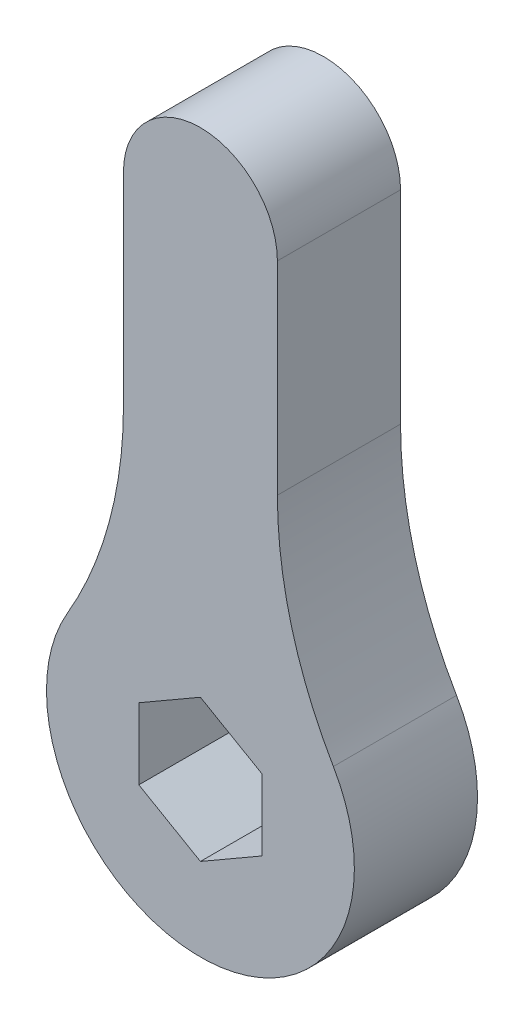
ISO-10303-21;
HEADER;
FILE_DESCRIPTION(('STEP AP214'),'2;1');
FILE_NAME('part.step','',(''),(''),'','','');
FILE_SCHEMA(('AUTOMOTIVE_DESIGN { 1 0 10303 214 1 1 1 1 }'));
ENDSEC;
DATA;
#1=APPLICATION_CONTEXT('core data for automotive mechanical design processes');
#2=APPLICATION_PROTOCOL_DEFINITION('international standard','automotive_design',2000,#1);
#3=PRODUCT_CONTEXT('',#1,'mechanical');
#4=PRODUCT('Part','Part','',(#3));
#5=PRODUCT_RELATED_PRODUCT_CATEGORY('part','',(#4));
#6=PRODUCT_DEFINITION_FORMATION('','',#4);
#7=PRODUCT_DEFINITION_CONTEXT('part definition',#1,'design');
#8=PRODUCT_DEFINITION('design','',#6,#7);
#9=PRODUCT_DEFINITION_SHAPE('','',#8);
#10=(LENGTH_UNIT() NAMED_UNIT(*) SI_UNIT(.MILLI.,.METRE.));
#11=(NAMED_UNIT(*) PLANE_ANGLE_UNIT() SI_UNIT($,.RADIAN.));
#12=(NAMED_UNIT(*) SI_UNIT($,.STERADIAN.) SOLID_ANGLE_UNIT());
#13=UNCERTAINTY_MEASURE_WITH_UNIT(LENGTH_MEASURE(1.E-05),#10,'distance_accuracy_value','');
#14=(GEOMETRIC_REPRESENTATION_CONTEXT(3) GLOBAL_UNCERTAINTY_ASSIGNED_CONTEXT((#13)) GLOBAL_UNIT_ASSIGNED_CONTEXT((#10,
#11,#12)) REPRESENTATION_CONTEXT('',''));
#15=CARTESIAN_POINT('',(0.,0.,0.));
#16=DIRECTION('',(0.,0.,1.));
#17=DIRECTION('',(1.,0.,0.));
#18=AXIS2_PLACEMENT_3D('',#15,#16,#17);
#19=CARTESIAN_POINT('',(0.,23.75,6.));
#20=DIRECTION('',(0.,0.,-1.));
#21=DIRECTION('',(-1.,0.,0.));
#22=AXIS2_PLACEMENT_3D('',#19,#20,#21);
#23=PLANE('',#22);
#24=CARTESIAN_POINT('',(0.,23.75,6.));
#25=DIRECTION('',(0.,0.,1.));
#26=DIRECTION('',(-1.,0.,0.));
#27=AXIS2_PLACEMENT_3D('',#24,#25,#26);
#28=CIRCLE('',#27,3.75);
#29=CARTESIAN_POINT('',(3.75,23.75,6.));
#30=VERTEX_POINT('',#29);
#31=CARTESIAN_POINT('',(-3.75,23.75,6.));
#32=VERTEX_POINT('',#31);
#33=EDGE_CURVE('E198',#30,#32,#28,.T.);
#34=ORIENTED_EDGE('',*,*,#33,.T.);
#35=DIRECTION('',(0.,-1.,0.));
#36=VECTOR('',#35,1.);
#37=CARTESIAN_POINT('',(-3.75,13.8631706330118,6.));
#38=LINE('',#37,#36);
#39=CARTESIAN_POINT('',(-3.75,13.8631706330118,6.));
#40=VERTEX_POINT('',#39);
#41=EDGE_CURVE('E202',#32,#40,#38,.T.);
#42=ORIENTED_EDGE('',*,*,#41,.T.);
#43=CARTESIAN_POINT('',(-23.75,13.8631706330118,6.));
#44=DIRECTION('',(0.,0.,-1.));
#45=DIRECTION('',(-1.,0.,0.));
#46=AXIS2_PLACEMENT_3D('',#43,#44,#45);
#47=CIRCLE('',#46,20.);
#48=CARTESIAN_POINT('',(-6.47727272727273,3.78086471809412,6.));
#49=VERTEX_POINT('',#48);
#50=EDGE_CURVE('E206',#40,#49,#47,.T.);
#51=ORIENTED_EDGE('',*,*,#50,.T.);
#52=CARTESIAN_POINT('',(0.,0.,6.));
#53=DIRECTION('',(0.,0.,1.));
#54=DIRECTION('',(1.,0.,0.));
#55=AXIS2_PLACEMENT_3D('',#52,#53,#54);
#56=CIRCLE('',#55,7.5);
#57=CARTESIAN_POINT('',(6.47727272727273,3.78086471809413,6.));
#58=VERTEX_POINT('',#57);
#59=EDGE_CURVE('E209',#49,#58,#56,.T.);
#60=ORIENTED_EDGE('',*,*,#59,.T.);
#61=CARTESIAN_POINT('',(23.75,13.8631706330118,6.));
#62=DIRECTION('',(0.,0.,-1.));
#63=DIRECTION('',(1.,0.,0.));
#64=AXIS2_PLACEMENT_3D('',#61,#62,#63);
#65=CIRCLE('',#64,20.);
#66=CARTESIAN_POINT('',(3.75,13.8631706330118,6.));
#67=VERTEX_POINT('',#66);
#68=EDGE_CURVE('E212',#58,#67,#65,.T.);
#69=ORIENTED_EDGE('',*,*,#68,.T.);
#70=DIRECTION('',(0.,1.,0.));
#71=VECTOR('',#70,1.);
#72=CARTESIAN_POINT('',(3.75,13.8631706330118,6.));
#73=LINE('',#72,#71);
#74=EDGE_CURVE('E215',#67,#30,#73,.T.);
#75=ORIENTED_EDGE('',*,*,#74,.T.);
#76=EDGE_LOOP('',(#34,#42,#51,#60,#69,#75));
#77=FACE_BOUND('',#76,.T.);
#78=DIRECTION('',(-0.866025403784439,0.5,0.));
#79=VECTOR('',#78,1.);
#80=CARTESIAN_POINT('',(3.,1.73205080756888,6.));
#81=LINE('',#80,#79);
#82=CARTESIAN_POINT('',(3.,1.73205080756888,6.));
#83=VERTEX_POINT('',#82);
#84=CARTESIAN_POINT('',(0.,3.46410161513776,6.));
#85=VERTEX_POINT('',#84);
#86=EDGE_CURVE('E129',#83,#85,#81,.T.);
#87=ORIENTED_EDGE('',*,*,#86,.F.);
#88=DIRECTION('',(0.,1.,0.));
#89=VECTOR('',#88,1.);
#90=CARTESIAN_POINT('',(3.,-1.73205080756888,6.));
#91=LINE('',#90,#89);
#92=CARTESIAN_POINT('',(3.,-1.73205080756888,6.));
#93=VERTEX_POINT('',#92);
#94=EDGE_CURVE('E164',#93,#83,#91,.T.);
#95=ORIENTED_EDGE('',*,*,#94,.F.);
#96=DIRECTION('',(0.866025403784439,0.5,0.));
#97=VECTOR('',#96,1.);
#98=CARTESIAN_POINT('',(0.,-3.46410161513776,6.));
#99=LINE('',#98,#97);
#100=CARTESIAN_POINT('',(0.,-3.46410161513776,6.));
#101=VERTEX_POINT('',#100);
#102=EDGE_CURVE('E161',#101,#93,#99,.T.);
#103=ORIENTED_EDGE('',*,*,#102,.F.);
#104=DIRECTION('',(0.866025403784439,-0.5,0.));
#105=VECTOR('',#104,1.);
#106=CARTESIAN_POINT('',(-3.,-1.73205080756888,6.));
#107=LINE('',#106,#105);
#108=CARTESIAN_POINT('',(-3.,-1.73205080756888,6.));
#109=VERTEX_POINT('',#108);
#110=EDGE_CURVE('E156',#109,#101,#107,.T.);
#111=ORIENTED_EDGE('',*,*,#110,.F.);
#112=DIRECTION('',(0.,-1.,0.));
#113=VECTOR('',#112,1.);
#114=CARTESIAN_POINT('',(-3.,1.73205080756888,6.));
#115=LINE('',#114,#113);
#116=CARTESIAN_POINT('',(-3.,1.73205080756888,6.));
#117=VERTEX_POINT('',#116);
#118=EDGE_CURVE('E152',#117,#109,#115,.T.);
#119=ORIENTED_EDGE('',*,*,#118,.F.);
#120=DIRECTION('',(-0.866025403784439,-0.5,0.));
#121=VECTOR('',#120,1.);
#122=CARTESIAN_POINT('',(0.,3.46410161513776,6.));
#123=LINE('',#122,#121);
#124=EDGE_CURVE('E138',#85,#117,#123,.T.);
#125=ORIENTED_EDGE('',*,*,#124,.F.);
#126=EDGE_LOOP('',(#87,#95,#103,#111,#119,#125));
#127=FACE_BOUND('',#126,.T.);
#128=ADVANCED_FACE('F39',(#77,#127),#23,.F.);
#129=CARTESIAN_POINT('',(0.,23.75,0.));
#130=DIRECTION('',(0.,0.,-1.));
#131=DIRECTION('',(-1.,0.,0.));
#132=AXIS2_PLACEMENT_3D('',#129,#130,#131);
#133=PLANE('',#132);
#134=CARTESIAN_POINT('',(0.,23.75,0.));
#135=DIRECTION('',(0.,0.,1.));
#136=DIRECTION('',(-1.,0.,0.));
#137=AXIS2_PLACEMENT_3D('',#134,#135,#136);
#138=CIRCLE('',#137,3.75);
#139=CARTESIAN_POINT('',(3.75,23.75,0.));
#140=VERTEX_POINT('',#139);
#141=CARTESIAN_POINT('',(-3.75,23.75,0.));
#142=VERTEX_POINT('',#141);
#143=EDGE_CURVE('E147',#140,#142,#138,.T.);
#144=ORIENTED_EDGE('',*,*,#143,.F.);
#145=DIRECTION('',(0.,1.,0.));
#146=VECTOR('',#145,1.);
#147=CARTESIAN_POINT('',(3.75,13.8631706330118,0.));
#148=LINE('',#147,#146);
#149=CARTESIAN_POINT('',(3.75,13.8631706330118,0.));
#150=VERTEX_POINT('',#149);
#151=EDGE_CURVE('E203',#150,#140,#148,.T.);
#152=ORIENTED_EDGE('',*,*,#151,.F.);
#153=CARTESIAN_POINT('',(23.75,13.8631706330118,0.));
#154=DIRECTION('',(0.,0.,-1.));
#155=DIRECTION('',(1.,0.,0.));
#156=AXIS2_PLACEMENT_3D('',#153,#154,#155);
#157=CIRCLE('',#156,20.);
#158=CARTESIAN_POINT('',(6.47727272727273,3.78086471809413,0.));
#159=VERTEX_POINT('',#158);
#160=EDGE_CURVE('E231',#159,#150,#157,.T.);
#161=ORIENTED_EDGE('',*,*,#160,.F.);
#162=CARTESIAN_POINT('',(0.,0.,0.));
#163=DIRECTION('',(0.,0.,1.));
#164=DIRECTION('',(1.,0.,0.));
#165=AXIS2_PLACEMENT_3D('',#162,#163,#164);
#166=CIRCLE('',#165,7.5);
#167=CARTESIAN_POINT('',(-6.47727272727273,3.78086471809412,0.));
#168=VERTEX_POINT('',#167);
#169=EDGE_CURVE('E228',#168,#159,#166,.T.);
#170=ORIENTED_EDGE('',*,*,#169,.F.);
#171=CARTESIAN_POINT('',(-23.75,13.8631706330118,0.));
#172=DIRECTION('',(0.,0.,-1.));
#173=DIRECTION('',(-1.,0.,0.));
#174=AXIS2_PLACEMENT_3D('',#171,#172,#173);
#175=CIRCLE('',#174,20.);
#176=CARTESIAN_POINT('',(-3.75,13.8631706330118,0.));
#177=VERTEX_POINT('',#176);
#178=EDGE_CURVE('E225',#177,#168,#175,.T.);
#179=ORIENTED_EDGE('',*,*,#178,.F.);
#180=DIRECTION('',(0.,-1.,0.));
#181=VECTOR('',#180,1.);
#182=CARTESIAN_POINT('',(-3.75,13.8631706330118,0.));
#183=LINE('',#182,#181);
#184=EDGE_CURVE('E222',#142,#177,#183,.T.);
#185=ORIENTED_EDGE('',*,*,#184,.F.);
#186=EDGE_LOOP('',(#144,#152,#161,#170,#179,#185));
#187=FACE_BOUND('',#186,.T.);
#188=DIRECTION('',(0.,1.,0.));
#189=VECTOR('',#188,1.);
#190=CARTESIAN_POINT('',(3.,-1.73205080756888,0.));
#191=LINE('',#190,#189);
#192=CARTESIAN_POINT('',(3.,-1.73205080756888,0.));
#193=VERTEX_POINT('',#192);
#194=CARTESIAN_POINT('',(3.,1.73205080756888,0.));
#195=VERTEX_POINT('',#194);
#196=EDGE_CURVE('E139',#193,#195,#191,.T.);
#197=ORIENTED_EDGE('',*,*,#196,.T.);
#198=DIRECTION('',(-0.866025403784439,0.5,0.));
#199=VECTOR('',#198,1.);
#200=CARTESIAN_POINT('',(3.,1.73205080756888,0.));
#201=LINE('',#200,#199);
#202=CARTESIAN_POINT('',(0.,3.46410161513776,0.));
#203=VERTEX_POINT('',#202);
#204=EDGE_CURVE('E63',#195,#203,#201,.T.);
#205=ORIENTED_EDGE('',*,*,#204,.T.);
#206=DIRECTION('',(-0.866025403784439,-0.5,0.));
#207=VECTOR('',#206,1.);
#208=CARTESIAN_POINT('',(0.,3.46410161513776,0.));
#209=LINE('',#208,#207);
#210=CARTESIAN_POINT('',(-3.,1.73205080756888,0.));
#211=VERTEX_POINT('',#210);
#212=EDGE_CURVE('E145',#203,#211,#209,.T.);
#213=ORIENTED_EDGE('',*,*,#212,.T.);
#214=DIRECTION('',(0.,-1.,0.));
#215=VECTOR('',#214,1.);
#216=CARTESIAN_POINT('',(-3.,1.73205080756888,0.));
#217=LINE('',#216,#215);
#218=CARTESIAN_POINT('',(-3.,-1.73205080756888,0.));
#219=VERTEX_POINT('',#218);
#220=EDGE_CURVE('E171',#211,#219,#217,.T.);
#221=ORIENTED_EDGE('',*,*,#220,.T.);
#222=DIRECTION('',(0.866025403784439,-0.5,0.));
#223=VECTOR('',#222,1.);
#224=CARTESIAN_POINT('',(-3.,-1.73205080756888,0.));
#225=LINE('',#224,#223);
#226=CARTESIAN_POINT('',(0.,-3.46410161513776,0.));
#227=VERTEX_POINT('',#226);
#228=EDGE_CURVE('E175',#219,#227,#225,.T.);
#229=ORIENTED_EDGE('',*,*,#228,.T.);
#230=DIRECTION('',(0.866025403784439,0.5,0.));
#231=VECTOR('',#230,1.);
#232=CARTESIAN_POINT('',(0.,-3.46410161513776,0.));
#233=LINE('',#232,#231);
#234=EDGE_CURVE('E179',#227,#193,#233,.T.);
#235=ORIENTED_EDGE('',*,*,#234,.T.);
#236=EDGE_LOOP('',(#197,#205,#213,#221,#229,#235));
#237=FACE_BOUND('',#236,.T.);
#238=ADVANCED_FACE('F262',(#187,#237),#133,.T.);
#239=CARTESIAN_POINT('',(0.,23.75,6.));
#240=DIRECTION('',(0.,0.,-1.));
#241=DIRECTION('',(-1.,0.,0.));
#242=AXIS2_PLACEMENT_3D('',#239,#240,#241);
#243=CYLINDRICAL_SURFACE('',#242,3.75);
#244=ORIENTED_EDGE('',*,*,#143,.T.);
#245=DIRECTION('',(0.,0.,-1.));
#246=VECTOR('',#245,1.);
#247=CARTESIAN_POINT('',(-3.75,23.75,6.));
#248=LINE('',#247,#246);
#249=EDGE_CURVE('E11',#32,#142,#248,.T.);
#250=ORIENTED_EDGE('',*,*,#249,.F.);
#251=ORIENTED_EDGE('',*,*,#33,.F.);
#252=DIRECTION('',(0.,0.,-1.));
#253=VECTOR('',#252,1.);
#254=CARTESIAN_POINT('',(3.75,23.75,6.));
#255=LINE('',#254,#253);
#256=EDGE_CURVE('E218',#30,#140,#255,.T.);
#257=ORIENTED_EDGE('',*,*,#256,.T.);
#258=EDGE_LOOP('',(#244,#250,#251,#257));
#259=FACE_BOUND('',#258,.T.);
#260=ADVANCED_FACE('F41',(#259),#243,.T.);
#261=CARTESIAN_POINT('',(-3.75,13.8631706330118,6.));
#262=DIRECTION('',(1.,0.,0.));
#263=DIRECTION('',(0.,0.,-1.));
#264=AXIS2_PLACEMENT_3D('',#261,#262,#263);
#265=PLANE('',#264);
#266=ORIENTED_EDGE('',*,*,#184,.T.);
#267=DIRECTION('',(0.,0.,-1.));
#268=VECTOR('',#267,1.);
#269=CARTESIAN_POINT('',(-3.75,13.8631706330118,6.));
#270=LINE('',#269,#268);
#271=EDGE_CURVE('E48',#40,#177,#270,.T.);
#272=ORIENTED_EDGE('',*,*,#271,.F.);
#273=ORIENTED_EDGE('',*,*,#41,.F.);
#274=ORIENTED_EDGE('',*,*,#249,.T.);
#275=EDGE_LOOP('',(#266,#272,#273,#274));
#276=FACE_BOUND('',#275,.T.);
#277=ADVANCED_FACE('F279',(#276),#265,.F.);
#278=CARTESIAN_POINT('',(-23.75,13.8631706330118,6.));
#279=DIRECTION('',(0.,0.,-1.));
#280=DIRECTION('',(-1.,0.,0.));
#281=AXIS2_PLACEMENT_3D('',#278,#279,#280);
#282=CYLINDRICAL_SURFACE('',#281,20.);
#283=ORIENTED_EDGE('',*,*,#178,.T.);
#284=DIRECTION('',(0.,0.,-1.));
#285=VECTOR('',#284,1.);
#286=CARTESIAN_POINT('',(-6.47727272727273,3.78086471809412,6.));
#287=LINE('',#286,#285);
#288=EDGE_CURVE('E247',#49,#168,#287,.T.);
#289=ORIENTED_EDGE('',*,*,#288,.F.);
#290=ORIENTED_EDGE('',*,*,#50,.F.);
#291=ORIENTED_EDGE('',*,*,#271,.T.);
#292=EDGE_LOOP('',(#283,#289,#290,#291));
#293=FACE_BOUND('',#292,.T.);
#294=ADVANCED_FACE('F256',(#293),#282,.F.);
#295=CARTESIAN_POINT('',(0.,0.,6.));
#296=DIRECTION('',(0.,0.,-1.));
#297=DIRECTION('',(-1.,0.,0.));
#298=AXIS2_PLACEMENT_3D('',#295,#296,#297);
#299=CYLINDRICAL_SURFACE('',#298,7.5);
#300=ORIENTED_EDGE('',*,*,#169,.T.);
#301=DIRECTION('',(0.,0.,-1.));
#302=VECTOR('',#301,1.);
#303=CARTESIAN_POINT('',(6.47727272727273,3.78086471809413,6.));
#304=LINE('',#303,#302);
#305=EDGE_CURVE('E243',#58,#159,#304,.T.);
#306=ORIENTED_EDGE('',*,*,#305,.F.);
#307=ORIENTED_EDGE('',*,*,#59,.F.);
#308=ORIENTED_EDGE('',*,*,#288,.T.);
#309=EDGE_LOOP('',(#300,#306,#307,#308));
#310=FACE_BOUND('',#309,.T.);
#311=ADVANCED_FACE('F268',(#310),#299,.T.);
#312=CARTESIAN_POINT('',(23.75,13.8631706330118,6.));
#313=DIRECTION('',(0.,0.,-1.));
#314=DIRECTION('',(-1.,0.,0.));
#315=AXIS2_PLACEMENT_3D('',#312,#313,#314);
#316=CYLINDRICAL_SURFACE('',#315,20.);
#317=ORIENTED_EDGE('',*,*,#160,.T.);
#318=DIRECTION('',(0.,0.,-1.));
#319=VECTOR('',#318,1.);
#320=CARTESIAN_POINT('',(3.75,13.8631706330118,6.));
#321=LINE('',#320,#319);
#322=EDGE_CURVE('E239',#67,#150,#321,.T.);
#323=ORIENTED_EDGE('',*,*,#322,.F.);
#324=ORIENTED_EDGE('',*,*,#68,.F.);
#325=ORIENTED_EDGE('',*,*,#305,.T.);
#326=EDGE_LOOP('',(#317,#323,#324,#325));
#327=FACE_BOUND('',#326,.T.);
#328=ADVANCED_FACE('F272',(#327),#316,.F.);
#329=CARTESIAN_POINT('',(3.75,13.8631706330118,6.));
#330=DIRECTION('',(-1.,0.,0.));
#331=DIRECTION('',(0.,0.,1.));
#332=AXIS2_PLACEMENT_3D('',#329,#330,#331);
#333=PLANE('',#332);
#334=ORIENTED_EDGE('',*,*,#151,.T.);
#335=ORIENTED_EDGE('',*,*,#256,.F.);
#336=ORIENTED_EDGE('',*,*,#74,.F.);
#337=ORIENTED_EDGE('',*,*,#322,.T.);
#338=EDGE_LOOP('',(#334,#335,#336,#337));
#339=FACE_BOUND('',#338,.T.);
#340=ADVANCED_FACE('F282',(#339),#333,.F.);
#341=CARTESIAN_POINT('',(3.,1.73205080756888,6.));
#342=DIRECTION('',(-0.5,-0.866025403784439,0.));
#343=DIRECTION('',(0.866025403784439,-0.5,0.));
#344=AXIS2_PLACEMENT_3D('',#341,#342,#343);
#345=PLANE('',#344);
#346=ORIENTED_EDGE('',*,*,#204,.F.);
#347=DIRECTION('',(0.,0.,-1.));
#348=VECTOR('',#347,1.);
#349=CARTESIAN_POINT('',(3.,1.73205080756888,6.));
#350=LINE('',#349,#348);
#351=EDGE_CURVE('E133',#83,#195,#350,.T.);
#352=ORIENTED_EDGE('',*,*,#351,.F.);
#353=ORIENTED_EDGE('',*,*,#86,.T.);
#354=DIRECTION('',(0.,0.,-1.));
#355=VECTOR('',#354,1.);
#356=CARTESIAN_POINT('',(0.,3.46410161513776,6.));
#357=LINE('',#356,#355);
#358=EDGE_CURVE('E132',#85,#203,#357,.T.);
#359=ORIENTED_EDGE('',*,*,#358,.T.);
#360=EDGE_LOOP('',(#346,#352,#353,#359));
#361=FACE_BOUND('',#360,.T.);
#362=ADVANCED_FACE('F131',(#361),#345,.T.);
#363=CARTESIAN_POINT('',(0.,3.46410161513776,6.));
#364=DIRECTION('',(0.5,-0.866025403784439,0.));
#365=DIRECTION('',(0.866025403784439,0.5,0.));
#366=AXIS2_PLACEMENT_3D('',#363,#364,#365);
#367=PLANE('',#366);
#368=ORIENTED_EDGE('',*,*,#212,.F.);
#369=ORIENTED_EDGE('',*,*,#358,.F.);
#370=ORIENTED_EDGE('',*,*,#124,.T.);
#371=DIRECTION('',(0.,0.,-1.));
#372=VECTOR('',#371,1.);
#373=CARTESIAN_POINT('',(-3.,1.73205080756888,6.));
#374=LINE('',#373,#372);
#375=EDGE_CURVE('E148',#117,#211,#374,.T.);
#376=ORIENTED_EDGE('',*,*,#375,.T.);
#377=EDGE_LOOP('',(#368,#369,#370,#376));
#378=FACE_BOUND('',#377,.T.);
#379=ADVANCED_FACE('F142',(#378),#367,.T.);
#380=CARTESIAN_POINT('',(-3.,1.73205080756888,6.));
#381=DIRECTION('',(1.,0.,0.));
#382=DIRECTION('',(0.,1.,0.));
#383=AXIS2_PLACEMENT_3D('',#380,#381,#382);
#384=PLANE('',#383);
#385=ORIENTED_EDGE('',*,*,#220,.F.);
#386=ORIENTED_EDGE('',*,*,#375,.F.);
#387=ORIENTED_EDGE('',*,*,#118,.T.);
#388=DIRECTION('',(0.,0.,-1.));
#389=VECTOR('',#388,1.);
#390=CARTESIAN_POINT('',(-3.,-1.73205080756888,6.));
#391=LINE('',#390,#389);
#392=EDGE_CURVE('E193',#109,#219,#391,.T.);
#393=ORIENTED_EDGE('',*,*,#392,.T.);
#394=EDGE_LOOP('',(#385,#386,#387,#393));
#395=FACE_BOUND('',#394,.T.);
#396=ADVANCED_FACE('F300',(#395),#384,.T.);
#397=CARTESIAN_POINT('',(-3.,-1.73205080756888,6.));
#398=DIRECTION('',(0.5,0.866025403784439,0.));
#399=DIRECTION('',(-0.866025403784439,0.5,0.));
#400=AXIS2_PLACEMENT_3D('',#397,#398,#399);
#401=PLANE('',#400);
#402=ORIENTED_EDGE('',*,*,#228,.F.);
#403=ORIENTED_EDGE('',*,*,#392,.F.);
#404=ORIENTED_EDGE('',*,*,#110,.T.);
#405=DIRECTION('',(0.,0.,-1.));
#406=VECTOR('',#405,1.);
#407=CARTESIAN_POINT('',(0.,-3.46410161513776,6.));
#408=LINE('',#407,#406);
#409=EDGE_CURVE('E190',#101,#227,#408,.T.);
#410=ORIENTED_EDGE('',*,*,#409,.T.);
#411=EDGE_LOOP('',(#402,#403,#404,#410));
#412=FACE_BOUND('',#411,.T.);
#413=ADVANCED_FACE('F303',(#412),#401,.T.);
#414=CARTESIAN_POINT('',(0.,-3.46410161513776,6.));
#415=DIRECTION('',(-0.5,0.866025403784439,0.));
#416=DIRECTION('',(-0.866025403784439,-0.5,0.));
#417=AXIS2_PLACEMENT_3D('',#414,#415,#416);
#418=PLANE('',#417);
#419=ORIENTED_EDGE('',*,*,#234,.F.);
#420=ORIENTED_EDGE('',*,*,#409,.F.);
#421=ORIENTED_EDGE('',*,*,#102,.T.);
#422=DIRECTION('',(0.,0.,-1.));
#423=VECTOR('',#422,1.);
#424=CARTESIAN_POINT('',(3.,-1.73205080756888,6.));
#425=LINE('',#424,#423);
#426=EDGE_CURVE('E55',#93,#193,#425,.T.);
#427=ORIENTED_EDGE('',*,*,#426,.T.);
#428=EDGE_LOOP('',(#419,#420,#421,#427));
#429=FACE_BOUND('',#428,.T.);
#430=ADVANCED_FACE('F307',(#429),#418,.T.);
#431=CARTESIAN_POINT('',(3.,-1.73205080756888,6.));
#432=DIRECTION('',(-1.,0.,0.));
#433=DIRECTION('',(0.,0.,1.));
#434=AXIS2_PLACEMENT_3D('',#431,#432,#433);
#435=PLANE('',#434);
#436=ORIENTED_EDGE('',*,*,#196,.F.);
#437=ORIENTED_EDGE('',*,*,#426,.F.);
#438=ORIENTED_EDGE('',*,*,#94,.T.);
#439=ORIENTED_EDGE('',*,*,#351,.T.);
#440=EDGE_LOOP('',(#436,#437,#438,#439));
#441=FACE_BOUND('',#440,.T.);
#442=ADVANCED_FACE('F311',(#441),#435,.T.);
#443=CLOSED_SHELL('',(#128,#238,#260,#277,#294,#311,#328,#340,#362,#379,#396,#413,#430,#442));
#444=MANIFOLD_SOLID_BREP('B2',#443);
#445=ADVANCED_BREP_SHAPE_REPRESENTATION('',(#18,#444),#14);
#446=SHAPE_DEFINITION_REPRESENTATION(#9,#445);
ENDSEC;
END-ISO-10303-21;
